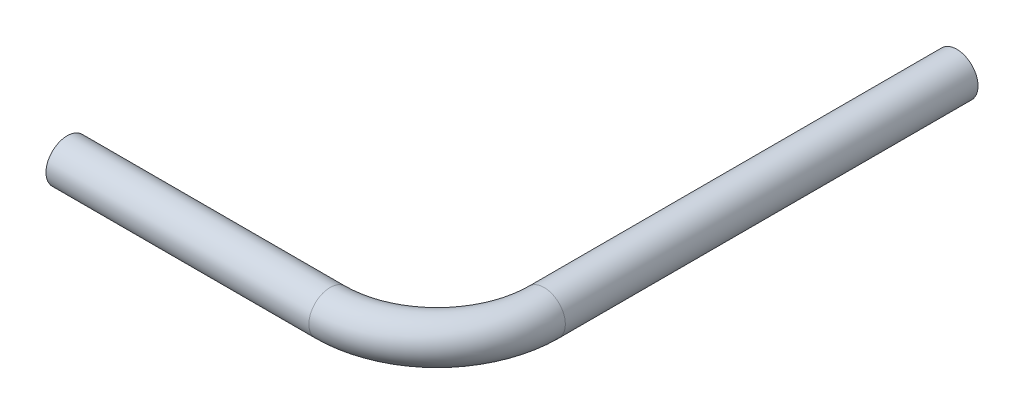
ISO-10303-21;
HEADER;
FILE_DESCRIPTION(('STEP AP214'),'2;1');
FILE_NAME('part.step','',(''),(''),'','','');
FILE_SCHEMA(('AUTOMOTIVE_DESIGN { 1 0 10303 214 1 1 1 1 }'));
ENDSEC;
DATA;
#1=APPLICATION_CONTEXT('core data for automotive mechanical design processes');
#2=APPLICATION_PROTOCOL_DEFINITION('international standard','automotive_design',2000,#1);
#3=PRODUCT_CONTEXT('',#1,'mechanical');
#4=PRODUCT('Part','Part','',(#3));
#5=PRODUCT_RELATED_PRODUCT_CATEGORY('part','',(#4));
#6=PRODUCT_DEFINITION_FORMATION('','',#4);
#7=PRODUCT_DEFINITION_CONTEXT('part definition',#1,'design');
#8=PRODUCT_DEFINITION('design','',#6,#7);
#9=PRODUCT_DEFINITION_SHAPE('','',#8);
#10=(LENGTH_UNIT() NAMED_UNIT(*) SI_UNIT(.MILLI.,.METRE.));
#11=(NAMED_UNIT(*) PLANE_ANGLE_UNIT() SI_UNIT($,.RADIAN.));
#12=(NAMED_UNIT(*) SI_UNIT($,.STERADIAN.) SOLID_ANGLE_UNIT());
#13=UNCERTAINTY_MEASURE_WITH_UNIT(LENGTH_MEASURE(1.E-05),#10,'distance_accuracy_value','');
#14=(GEOMETRIC_REPRESENTATION_CONTEXT(3) GLOBAL_UNCERTAINTY_ASSIGNED_CONTEXT((#13)) GLOBAL_UNIT_ASSIGNED_CONTEXT((#10,
#11,#12)) REPRESENTATION_CONTEXT('',''));
#15=CARTESIAN_POINT('',(0.,0.,0.));
#16=DIRECTION('',(0.,0.,1.));
#17=DIRECTION('',(1.,0.,0.));
#18=AXIS2_PLACEMENT_3D('',#15,#16,#17);
#19=CARTESIAN_POINT('',(0.,0.,0.));
#20=DIRECTION('',(1.,0.,0.));
#21=DIRECTION('',(0.,0.,-1.));
#22=AXIS2_PLACEMENT_3D('',#19,#20,#21);
#23=PLANE('',#22);
#24=CARTESIAN_POINT('',(0.,0.,0.));
#25=DIRECTION('',(1.,0.,0.));
#26=DIRECTION('',(0.,0.,-1.));
#27=AXIS2_PLACEMENT_3D('',#24,#25,#26);
#28=CIRCLE('',#27,2.4638);
#29=CARTESIAN_POINT('',(0.,0.,-2.4638));
#30=VERTEX_POINT('',#29);
#31=EDGE_CURVE('E54',#30,#30,#28,.T.);
#32=ORIENTED_EDGE('',*,*,#31,.T.);
#33=EDGE_LOOP('',(#32));
#34=FACE_BOUND('',#33,.T.);
#35=CARTESIAN_POINT('',(0.,0.,0.));
#36=DIRECTION('',(1.,0.,0.));
#37=DIRECTION('',(0.,0.,-1.));
#38=AXIS2_PLACEMENT_3D('',#35,#36,#37);
#39=CIRCLE('',#38,3.175);
#40=CARTESIAN_POINT('',(0.,0.,-3.175));
#41=VERTEX_POINT('',#40);
#42=EDGE_CURVE('E45',#41,#41,#39,.T.);
#43=ORIENTED_EDGE('',*,*,#42,.F.);
#44=EDGE_LOOP('',(#43));
#45=FACE_BOUND('',#44,.T.);
#46=ADVANCED_FACE('F31',(#34,#45),#23,.F.);
#47=CARTESIAN_POINT('',(55.3,0.,-77.69897428));
#48=DIRECTION('',(0.,0.,-1.));
#49=DIRECTION('',(-1.,0.,0.));
#50=AXIS2_PLACEMENT_3D('',#47,#48,#49);
#51=PLANE('',#50);
#52=CARTESIAN_POINT('',(55.3,0.,-77.69897428));
#53=DIRECTION('',(0.,0.,-1.));
#54=DIRECTION('',(-1.,0.,0.));
#55=AXIS2_PLACEMENT_3D('',#52,#53,#54);
#56=CIRCLE('',#55,2.4638);
#57=CARTESIAN_POINT('',(52.8362,0.,-77.69897428));
#58=VERTEX_POINT('',#57);
#59=EDGE_CURVE('E50',#58,#58,#56,.T.);
#60=ORIENTED_EDGE('',*,*,#59,.F.);
#61=EDGE_LOOP('',(#60));
#62=FACE_BOUND('',#61,.T.);
#63=CARTESIAN_POINT('',(55.3,0.,-77.69897428));
#64=DIRECTION('',(0.,0.,-1.));
#65=DIRECTION('',(-1.,0.,0.));
#66=AXIS2_PLACEMENT_3D('',#63,#64,#65);
#67=CIRCLE('',#66,3.175);
#68=CARTESIAN_POINT('',(52.125,0.,-77.69897428));
#69=VERTEX_POINT('',#68);
#70=EDGE_CURVE('E10',#69,#69,#67,.T.);
#71=ORIENTED_EDGE('',*,*,#70,.T.);
#72=EDGE_LOOP('',(#71));
#73=FACE_BOUND('',#72,.T.);
#74=ADVANCED_FACE('F90',(#62,#73),#51,.T.);
#75=CARTESIAN_POINT('',(0.,0.,0.));
#76=DIRECTION('',(1.,0.,0.));
#77=DIRECTION('',(0.,0.,-1.));
#78=AXIS2_PLACEMENT_3D('',#75,#76,#77);
#79=CYLINDRICAL_SURFACE('',#78,3.175);
#80=CARTESIAN_POINT('',(39.2999999999995,0.,0.));
#81=DIRECTION('',(1.,0.,0.));
#82=DIRECTION('',(0.,0.,-1.));
#83=AXIS2_PLACEMENT_3D('',#80,#81,#82);
#84=CIRCLE('',#83,3.175);
#85=CARTESIAN_POINT('',(39.2999999999995,0.,3.175));
#86=VERTEX_POINT('',#85);
#87=EDGE_CURVE('E41',#86,#86,#84,.T.);
#88=ORIENTED_EDGE('',*,*,#87,.F.);
#89=EDGE_LOOP('',(#88));
#90=FACE_BOUND('',#89,.T.);
#91=ORIENTED_EDGE('',*,*,#42,.T.);
#92=EDGE_LOOP('',(#91));
#93=FACE_BOUND('',#92,.T.);
#94=ADVANCED_FACE('F86',(#90,#93),#79,.T.);
#95=CARTESIAN_POINT('',(39.2999999999995,0.,-16.0000000000005));
#96=DIRECTION('',(0.,1.,0.));
#97=DIRECTION('',(0.,0.,1.));
#98=AXIS2_PLACEMENT_3D('',#95,#96,#97);
#99=TOROIDAL_SURFACE('',#98,16.0000000000005,3.175);
#100=CARTESIAN_POINT('',(55.3,0.,-16.0000000000005));
#101=DIRECTION('',(0.,0.,-1.));
#102=DIRECTION('',(-1.,0.,0.));
#103=AXIS2_PLACEMENT_3D('',#100,#101,#102);
#104=CIRCLE('',#103,3.175);
#105=CARTESIAN_POINT('',(58.475,0.,-16.0000000000005));
#106=VERTEX_POINT('',#105);
#107=EDGE_CURVE('E37',#106,#106,#104,.T.);
#108=CARTESIAN_POINT('',(39.2999999999995,0.,-16.0000000000005));
#109=DIRECTION('',(0.,1.,0.));
#110=DIRECTION('',(0.,0.,1.));
#111=AXIS2_PLACEMENT_3D('',#108,#109,#110);
#112=CIRCLE('',#111,19.1750000000005);
#113=EDGE_CURVE('',#86,#106,#112,.T.);
#114=ORIENTED_EDGE('',*,*,#87,.T.);
#115=ORIENTED_EDGE('',*,*,#107,.F.);
#116=ORIENTED_EDGE('',*,*,#113,.T.);
#117=ORIENTED_EDGE('',*,*,#113,.F.);
#118=EDGE_LOOP('',(#114,#116,#115,#117));
#119=FACE_BOUND('',#118,.T.);
#120=ADVANCED_FACE('F80',(#119),#99,.T.);
#121=CARTESIAN_POINT('',(55.3,0.,-16.0000000000005));
#122=DIRECTION('',(0.,0.,-1.));
#123=DIRECTION('',(-1.,0.,0.));
#124=AXIS2_PLACEMENT_3D('',#121,#122,#123);
#125=CYLINDRICAL_SURFACE('',#124,3.175);
#126=ORIENTED_EDGE('',*,*,#70,.F.);
#127=EDGE_LOOP('',(#126));
#128=FACE_BOUND('',#127,.T.);
#129=ORIENTED_EDGE('',*,*,#107,.T.);
#130=EDGE_LOOP('',(#129));
#131=FACE_BOUND('',#130,.T.);
#132=ADVANCED_FACE('F77',(#128,#131),#125,.T.);
#133=CARTESIAN_POINT('',(0.,0.,0.));
#134=DIRECTION('',(1.,0.,0.));
#135=DIRECTION('',(0.,0.,-1.));
#136=AXIS2_PLACEMENT_3D('',#133,#134,#135);
#137=CYLINDRICAL_SURFACE('',#136,2.4638);
#138=CARTESIAN_POINT('',(39.2999999999995,0.,0.));
#139=DIRECTION('',(-1.,0.,0.));
#140=DIRECTION('',(0.,0.,1.));
#141=AXIS2_PLACEMENT_3D('',#138,#139,#140);
#142=CIRCLE('',#141,2.4638);
#143=CARTESIAN_POINT('',(39.2999999999995,0.,2.4638));
#144=VERTEX_POINT('',#143);
#145=EDGE_CURVE('E57',#144,#144,#142,.F.);
#146=ORIENTED_EDGE('',*,*,#145,.T.);
#147=EDGE_LOOP('',(#146));
#148=FACE_BOUND('',#147,.T.);
#149=ORIENTED_EDGE('',*,*,#31,.F.);
#150=EDGE_LOOP('',(#149));
#151=FACE_BOUND('',#150,.T.);
#152=ADVANCED_FACE('F63',(#148,#151),#137,.F.);
#153=CARTESIAN_POINT('',(39.2999999999995,0.,-16.0000000000005));
#154=DIRECTION('',(0.,1.,0.));
#155=DIRECTION('',(0.,0.,1.));
#156=AXIS2_PLACEMENT_3D('',#153,#154,#155);
#157=TOROIDAL_SURFACE('',#156,16.0000000000005,2.4638);
#158=CARTESIAN_POINT('',(55.3,0.,-16.0000000000005));
#159=DIRECTION('',(0.,0.,-1.));
#160=DIRECTION('',(-1.,0.,0.));
#161=AXIS2_PLACEMENT_3D('',#158,#159,#160);
#162=CIRCLE('',#161,2.4638);
#163=CARTESIAN_POINT('',(57.7638,0.,-16.0000000000005));
#164=VERTEX_POINT('',#163);
#165=EDGE_CURVE('E53',#164,#164,#162,.T.);
#166=CARTESIAN_POINT('',(39.2999999999995,0.,-16.0000000000005));
#167=DIRECTION('',(0.,1.,0.));
#168=DIRECTION('',(0.,0.,1.));
#169=AXIS2_PLACEMENT_3D('',#166,#167,#168);
#170=CIRCLE('',#169,18.4638000000005);
#171=EDGE_CURVE('',#144,#164,#170,.T.);
#172=ORIENTED_EDGE('',*,*,#145,.F.);
#173=ORIENTED_EDGE('',*,*,#165,.T.);
#174=ORIENTED_EDGE('',*,*,#171,.T.);
#175=ORIENTED_EDGE('',*,*,#171,.F.);
#176=EDGE_LOOP('',(#172,#174,#173,#175));
#177=FACE_BOUND('',#176,.T.);
#178=ADVANCED_FACE('F66',(#177),#157,.F.);
#179=CARTESIAN_POINT('',(55.3,0.,-16.0000000000005));
#180=DIRECTION('',(0.,0.,-1.));
#181=DIRECTION('',(-1.,0.,0.));
#182=AXIS2_PLACEMENT_3D('',#179,#180,#181);
#183=CYLINDRICAL_SURFACE('',#182,2.4638);
#184=ORIENTED_EDGE('',*,*,#59,.T.);
#185=EDGE_LOOP('',(#184));
#186=FACE_BOUND('',#185,.T.);
#187=ORIENTED_EDGE('',*,*,#165,.F.);
#188=EDGE_LOOP('',(#187));
#189=FACE_BOUND('',#188,.T.);
#190=ADVANCED_FACE('F68',(#186,#189),#183,.F.);
#191=CLOSED_SHELL('',(#46,#74,#94,#120,#132,#152,#178,#190));
#192=MANIFOLD_SOLID_BREP('B2',#191);
#193=ADVANCED_BREP_SHAPE_REPRESENTATION('',(#18,#192),#14);
#194=SHAPE_DEFINITION_REPRESENTATION(#9,#193);
ENDSEC;
END-ISO-10303-21;
